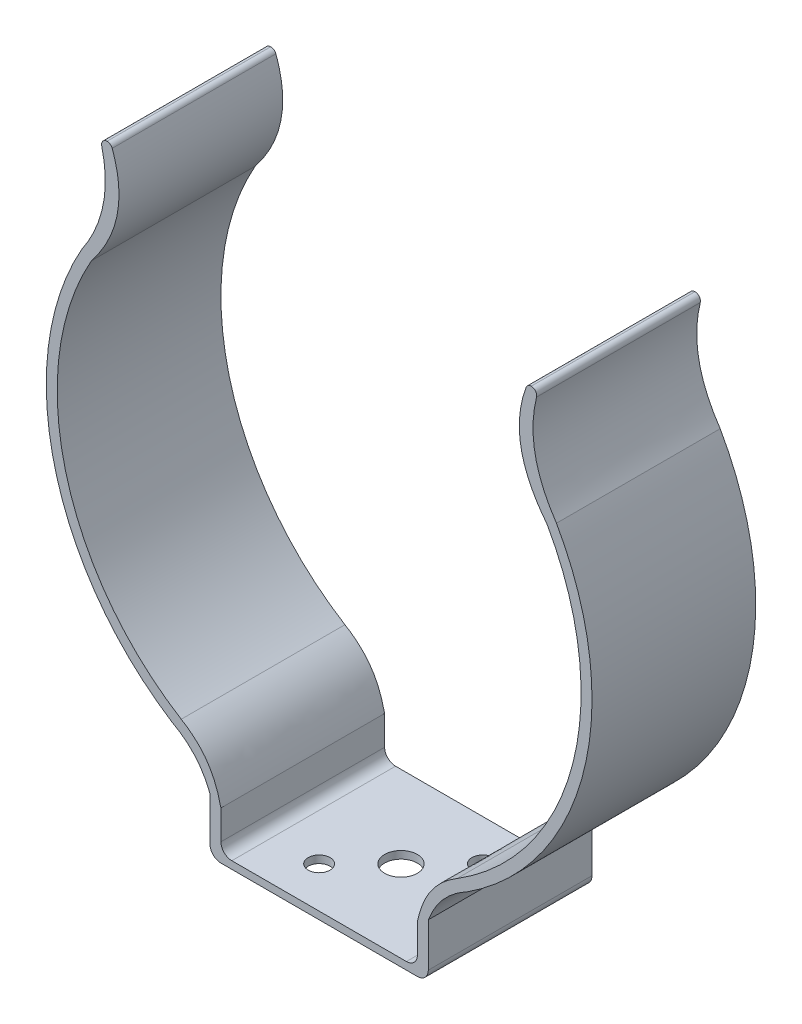
ISO-10303-21;
HEADER;
FILE_DESCRIPTION(('STEP AP214'),'2;1');
FILE_NAME('part.step','',(''),(''),'','','');
FILE_SCHEMA(('AUTOMOTIVE_DESIGN { 1 0 10303 214 1 1 1 1 }'));
ENDSEC;
DATA;
#1=APPLICATION_CONTEXT('core data for automotive mechanical design processes');
#2=APPLICATION_PROTOCOL_DEFINITION('international standard','automotive_design',2000,#1);
#3=PRODUCT_CONTEXT('',#1,'mechanical');
#4=PRODUCT('Part','Part','',(#3));
#5=PRODUCT_RELATED_PRODUCT_CATEGORY('part','',(#4));
#6=PRODUCT_DEFINITION_FORMATION('','',#4);
#7=PRODUCT_DEFINITION_CONTEXT('part definition',#1,'design');
#8=PRODUCT_DEFINITION('design','',#6,#7);
#9=PRODUCT_DEFINITION_SHAPE('','',#8);
#10=(LENGTH_UNIT() NAMED_UNIT(*) SI_UNIT(.MILLI.,.METRE.));
#11=(NAMED_UNIT(*) PLANE_ANGLE_UNIT() SI_UNIT($,.RADIAN.));
#12=(NAMED_UNIT(*) SI_UNIT($,.STERADIAN.) SOLID_ANGLE_UNIT());
#13=UNCERTAINTY_MEASURE_WITH_UNIT(LENGTH_MEASURE(1.E-05),#10,'distance_accuracy_value','');
#14=(GEOMETRIC_REPRESENTATION_CONTEXT(3) GLOBAL_UNCERTAINTY_ASSIGNED_CONTEXT((#13)) GLOBAL_UNIT_ASSIGNED_CONTEXT((#10,
#11,#12)) REPRESENTATION_CONTEXT('',''));
#15=CARTESIAN_POINT('',(0.,0.,0.));
#16=DIRECTION('',(0.,0.,1.));
#17=DIRECTION('',(1.,0.,0.));
#18=AXIS2_PLACEMENT_3D('',#15,#16,#17);
#19=CARTESIAN_POINT('',(-37.7417223823235,-58.7757168532688,41.91));
#20=CARTESIAN_POINT('',(-30.7257234779803,-62.4953821394087,41.91));
#21=CARTESIAN_POINT('',(-27.94,-69.85,41.91));
#22=B_SPLINE_CURVE_WITH_KNOTS('',2,(#19,#20,#21),.UNSPECIFIED.,.F.,.F.,(3,3),(0.,1.),.UNSPECIFIED.);
#23=DIRECTION('',(0.,0.,-1.));
#24=VECTOR('',#23,1.);
#25=SURFACE_OF_LINEAR_EXTRUSION('',#22,#24);
#26=CARTESIAN_POINT('',(-37.7417223823235,-58.7757168532688,0.));
#27=CARTESIAN_POINT('',(-30.7257234779803,-62.4953821394087,0.));
#28=CARTESIAN_POINT('',(-27.94,-69.85,0.));
#29=B_SPLINE_CURVE_WITH_KNOTS('',2,(#26,#27,#28),.UNSPECIFIED.,.F.,.F.,(3,3),(0.,1.),.UNSPECIFIED.);
#30=CARTESIAN_POINT('',(-37.7417223823235,-58.7757168532688,0.));
#31=VERTEX_POINT('',#30);
#32=CARTESIAN_POINT('',(-27.94,-69.85,0.));
#33=VERTEX_POINT('',#32);
#34=EDGE_CURVE('E241',#31,#33,#29,.T.);
#35=ORIENTED_EDGE('',*,*,#34,.T.);
#36=DIRECTION('',(0.,0.,-1.));
#37=VECTOR('',#36,1.);
#38=CARTESIAN_POINT('',(-27.94,-69.85,41.91));
#39=LINE('',#38,#37);
#40=CARTESIAN_POINT('',(-27.94,-69.85,41.91));
#41=VERTEX_POINT('',#40);
#42=EDGE_CURVE('E224',#41,#33,#39,.T.);
#43=ORIENTED_EDGE('',*,*,#42,.F.);
#44=CARTESIAN_POINT('',(-37.7417223823235,-58.7757168532688,41.91));
#45=VERTEX_POINT('',#44);
#46=EDGE_CURVE('E229',#45,#41,#22,.T.);
#47=ORIENTED_EDGE('',*,*,#46,.F.);
#48=DIRECTION('',(0.,0.,-1.));
#49=VECTOR('',#48,1.);
#50=CARTESIAN_POINT('',(-37.7417223823235,-58.7757168532688,41.91));
#51=LINE('',#50,#49);
#52=EDGE_CURVE('E443',#45,#31,#51,.T.);
#53=ORIENTED_EDGE('',*,*,#52,.T.);
#54=EDGE_LOOP('',(#35,#43,#47,#53));
#55=FACE_BOUND('',#54,.T.);
#56=ADVANCED_FACE('F35',(#55),#25,.F.);
#57=CARTESIAN_POINT('',(-27.94,-69.85,41.91));
#58=DIRECTION('',(1.,0.,0.));
#59=DIRECTION('',(0.,0.,-1.));
#60=AXIS2_PLACEMENT_3D('',#57,#58,#59);
#61=PLANE('',#60);
#62=DIRECTION('',(0.,-1.,0.));
#63=VECTOR('',#62,1.);
#64=CARTESIAN_POINT('',(-27.94,-69.85,0.));
#65=LINE('',#64,#63);
#66=CARTESIAN_POINT('',(-27.94,-81.026,0.));
#67=VERTEX_POINT('',#66);
#68=EDGE_CURVE('E603',#33,#67,#65,.T.);
#69=ORIENTED_EDGE('',*,*,#68,.T.);
#70=DIRECTION('',(0.,0.,-1.));
#71=VECTOR('',#70,1.);
#72=CARTESIAN_POINT('',(-27.94,-81.026,41.91));
#73=LINE('',#72,#71);
#74=CARTESIAN_POINT('',(-27.94,-81.026,41.91));
#75=VERTEX_POINT('',#74);
#76=EDGE_CURVE('E50',#67,#75,#73,.F.);
#77=ORIENTED_EDGE('',*,*,#76,.T.);
#78=DIRECTION('',(0.,-1.,0.));
#79=VECTOR('',#78,1.);
#80=CARTESIAN_POINT('',(-27.94,-69.85,41.91));
#81=LINE('',#80,#79);
#82=EDGE_CURVE('E220',#41,#75,#81,.T.);
#83=ORIENTED_EDGE('',*,*,#82,.F.);
#84=ORIENTED_EDGE('',*,*,#42,.T.);
#85=EDGE_LOOP('',(#69,#77,#83,#84));
#86=FACE_BOUND('',#85,.T.);
#87=ADVANCED_FACE('F222',(#86),#61,.F.);
#88=CARTESIAN_POINT('',(-27.94,-83.82,41.91));
#89=DIRECTION('',(0.,1.,0.));
#90=DIRECTION('',(0.,0.,1.));
#91=AXIS2_PLACEMENT_3D('',#88,#89,#90);
#92=PLANE('',#91);
#93=CARTESIAN_POINT('',(-10.4775,-83.82,31.4325));
#94=DIRECTION('',(0.,1.,0.));
#95=DIRECTION('',(0.,0.,1.));
#96=AXIS2_PLACEMENT_3D('',#93,#94,#95);
#97=CIRCLE('',#96,2.794);
#98=CARTESIAN_POINT('',(-10.4775,-83.82,34.2265));
#99=VERTEX_POINT('',#98);
#100=EDGE_CURVE('E897',#99,#99,#97,.T.);
#101=ORIENTED_EDGE('',*,*,#100,.T.);
#102=EDGE_LOOP('',(#101));
#103=FACE_BOUND('',#102,.T.);
#104=CARTESIAN_POINT('',(10.4775,-83.82,10.4775));
#105=DIRECTION('',(0.,1.,0.));
#106=DIRECTION('',(0.,0.,1.));
#107=AXIS2_PLACEMENT_3D('',#104,#105,#106);
#108=CIRCLE('',#107,2.794);
#109=CARTESIAN_POINT('',(10.4775,-83.82,13.2715));
#110=VERTEX_POINT('',#109);
#111=EDGE_CURVE('E901',#110,#110,#108,.T.);
#112=ORIENTED_EDGE('',*,*,#111,.T.);
#113=EDGE_LOOP('',(#112));
#114=FACE_BOUND('',#113,.T.);
#115=CARTESIAN_POINT('',(0.,-83.82,20.955));
#116=DIRECTION('',(0.,1.,0.));
#117=DIRECTION('',(0.,0.,1.));
#118=AXIS2_PLACEMENT_3D('',#115,#116,#117);
#119=CIRCLE('',#118,4.191);
#120=CARTESIAN_POINT('',(0.,-83.82,25.146));
#121=VERTEX_POINT('',#120);
#122=EDGE_CURVE('E592',#121,#121,#119,.T.);
#123=ORIENTED_EDGE('',*,*,#122,.T.);
#124=EDGE_LOOP('',(#123));
#125=FACE_BOUND('',#124,.T.);
#126=DIRECTION('',(1.,0.,0.));
#127=VECTOR('',#126,1.);
#128=CARTESIAN_POINT('',(-27.94,-83.82,0.));
#129=LINE('',#128,#127);
#130=CARTESIAN_POINT('',(-25.146,-83.82,0.));
#131=VERTEX_POINT('',#130);
#132=CARTESIAN_POINT('',(25.146,-83.82,0.));
#133=VERTEX_POINT('',#132);
#134=EDGE_CURVE('E602',#131,#133,#129,.T.);
#135=ORIENTED_EDGE('',*,*,#134,.T.);
#136=DIRECTION('',(0.,0.,-1.));
#137=VECTOR('',#136,1.);
#138=CARTESIAN_POINT('',(25.146,-83.82,41.91));
#139=LINE('',#138,#137);
#140=CARTESIAN_POINT('',(25.146,-83.82,41.91));
#141=VERTEX_POINT('',#140);
#142=EDGE_CURVE('E58',#133,#141,#139,.F.);
#143=ORIENTED_EDGE('',*,*,#142,.T.);
#144=DIRECTION('',(1.,0.,0.));
#145=VECTOR('',#144,1.);
#146=CARTESIAN_POINT('',(-27.94,-83.82,41.91));
#147=LINE('',#146,#145);
#148=CARTESIAN_POINT('',(-25.146,-83.82,41.91));
#149=VERTEX_POINT('',#148);
#150=EDGE_CURVE('E228',#149,#141,#147,.T.);
#151=ORIENTED_EDGE('',*,*,#150,.F.);
#152=DIRECTION('',(0.,0.,-1.));
#153=VECTOR('',#152,1.);
#154=CARTESIAN_POINT('',(-25.146,-83.82,41.91));
#155=LINE('',#154,#153);
#156=EDGE_CURVE('E302',#149,#131,#155,.T.);
#157=ORIENTED_EDGE('',*,*,#156,.T.);
#158=EDGE_LOOP('',(#135,#143,#151,#157));
#159=FACE_BOUND('',#158,.T.);
#160=ADVANCED_FACE('F586',(#103,#114,#125,#159),#92,.F.);
#161=CARTESIAN_POINT('',(27.94,-69.85,41.91));
#162=DIRECTION('',(-1.,0.,0.));
#163=DIRECTION('',(0.,0.,1.));
#164=AXIS2_PLACEMENT_3D('',#161,#162,#163);
#165=PLANE('',#164);
#166=DIRECTION('',(0.,1.,0.));
#167=VECTOR('',#166,1.);
#168=CARTESIAN_POINT('',(27.94,-69.85,41.91));
#169=LINE('',#168,#167);
#170=CARTESIAN_POINT('',(27.94,-81.026,41.91));
#171=VERTEX_POINT('',#170);
#172=CARTESIAN_POINT('',(27.94,-69.85,41.91));
#173=VERTEX_POINT('',#172);
#174=EDGE_CURVE('E560',#171,#173,#169,.T.);
#175=ORIENTED_EDGE('',*,*,#174,.F.);
#176=DIRECTION('',(0.,0.,-1.));
#177=VECTOR('',#176,1.);
#178=CARTESIAN_POINT('',(27.94,-81.026,41.91));
#179=LINE('',#178,#177);
#180=CARTESIAN_POINT('',(27.94,-81.026,0.));
#181=VERTEX_POINT('',#180);
#182=EDGE_CURVE('E295',#171,#181,#179,.T.);
#183=ORIENTED_EDGE('',*,*,#182,.T.);
#184=DIRECTION('',(0.,1.,0.));
#185=VECTOR('',#184,1.);
#186=CARTESIAN_POINT('',(27.94,-69.85,0.));
#187=LINE('',#186,#185);
#188=CARTESIAN_POINT('',(27.94,-69.85,0.));
#189=VERTEX_POINT('',#188);
#190=EDGE_CURVE('E483',#181,#189,#187,.T.);
#191=ORIENTED_EDGE('',*,*,#190,.T.);
#192=DIRECTION('',(0.,0.,-1.));
#193=VECTOR('',#192,1.);
#194=CARTESIAN_POINT('',(27.94,-69.85,41.91));
#195=LINE('',#194,#193);
#196=EDGE_CURVE('E243',#173,#189,#195,.T.);
#197=ORIENTED_EDGE('',*,*,#196,.F.);
#198=EDGE_LOOP('',(#175,#183,#191,#197));
#199=FACE_BOUND('',#198,.T.);
#200=ADVANCED_FACE('F553',(#199),#165,.F.);
#201=CARTESIAN_POINT('',(27.94,-69.85,41.91));
#202=CARTESIAN_POINT('',(30.7257234779803,-62.4953821394087,41.91));
#203=CARTESIAN_POINT('',(37.7417223823235,-58.7757168532688,41.91));
#204=B_SPLINE_CURVE_WITH_KNOTS('',2,(#201,#202,#203),.UNSPECIFIED.,.F.,.F.,(3,3),(0.,1.),.UNSPECIFIED.);
#205=DIRECTION('',(0.,0.,-1.));
#206=VECTOR('',#205,1.);
#207=SURFACE_OF_LINEAR_EXTRUSION('',#204,#206);
#208=CARTESIAN_POINT('',(27.94,-69.85,0.));
#209=CARTESIAN_POINT('',(30.7257234779803,-62.4953821394087,0.));
#210=CARTESIAN_POINT('',(37.7417223823235,-58.7757168532688,0.));
#211=B_SPLINE_CURVE_WITH_KNOTS('',2,(#208,#209,#210),.UNSPECIFIED.,.F.,.F.,(3,3),(0.,1.),.UNSPECIFIED.);
#212=CARTESIAN_POINT('',(37.7417223823235,-58.7757168532688,0.));
#213=VERTEX_POINT('',#212);
#214=EDGE_CURVE('E477',#189,#213,#211,.T.);
#215=ORIENTED_EDGE('',*,*,#214,.T.);
#216=DIRECTION('',(0.,0.,-1.));
#217=VECTOR('',#216,1.);
#218=CARTESIAN_POINT('',(37.7417223823235,-58.7757168532688,41.91));
#219=LINE('',#218,#217);
#220=CARTESIAN_POINT('',(37.7417223823235,-58.7757168532688,41.91));
#221=VERTEX_POINT('',#220);
#222=EDGE_CURVE('E248',#221,#213,#219,.T.);
#223=ORIENTED_EDGE('',*,*,#222,.F.);
#224=EDGE_CURVE('E555',#173,#221,#204,.T.);
#225=ORIENTED_EDGE('',*,*,#224,.F.);
#226=ORIENTED_EDGE('',*,*,#196,.T.);
#227=EDGE_LOOP('',(#215,#223,#225,#226));
#228=FACE_BOUND('',#227,.T.);
#229=ADVANCED_FACE('F549',(#228),#207,.F.);
#230=CARTESIAN_POINT('',(0.,0.,41.91));
#231=DIRECTION('',(0.,0.,-1.));
#232=DIRECTION('',(-1.,0.,0.));
#233=AXIS2_PLACEMENT_3D('',#230,#231,#232);
#234=CYLINDRICAL_SURFACE('',#233,69.85);
#235=CARTESIAN_POINT('',(0.,0.,0.));
#236=DIRECTION('',(0.,0.,1.));
#237=DIRECTION('',(1.,0.,0.));
#238=AXIS2_PLACEMENT_3D('',#235,#236,#237);
#239=CIRCLE('',#238,69.85);
#240=CARTESIAN_POINT('',(60.746853256944,34.4795927960194,0.));
#241=VERTEX_POINT('',#240);
#242=EDGE_CURVE('E471',#213,#241,#239,.T.);
#243=ORIENTED_EDGE('',*,*,#242,.T.);
#244=DIRECTION('',(0.,0.,-1.));
#245=VECTOR('',#244,1.);
#246=CARTESIAN_POINT('',(60.746853256944,34.4795927960194,41.91));
#247=LINE('',#246,#245);
#248=CARTESIAN_POINT('',(60.746853256944,34.4795927960194,41.91));
#249=VERTEX_POINT('',#248);
#250=EDGE_CURVE('E462',#249,#241,#247,.T.);
#251=ORIENTED_EDGE('',*,*,#250,.F.);
#252=CARTESIAN_POINT('',(0.,0.,41.91));
#253=DIRECTION('',(0.,0.,1.));
#254=DIRECTION('',(1.,0.,0.));
#255=AXIS2_PLACEMENT_3D('',#252,#253,#254);
#256=CIRCLE('',#255,69.85);
#257=EDGE_CURVE('E472',#221,#249,#256,.T.);
#258=ORIENTED_EDGE('',*,*,#257,.F.);
#259=ORIENTED_EDGE('',*,*,#222,.T.);
#260=EDGE_LOOP('',(#243,#251,#258,#259));
#261=FACE_BOUND('',#260,.T.);
#262=ADVANCED_FACE('F469',(#261),#234,.T.);
#263=CARTESIAN_POINT('',(60.746853256944,34.4795927960194,41.91));
#264=CARTESIAN_POINT('',(51.8584734263905,47.5166520458032,41.91));
#265=CARTESIAN_POINT('',(56.1335534346627,61.6254964464781,41.91));
#266=B_SPLINE_CURVE_WITH_KNOTS('',2,(#263,#264,#265),.UNSPECIFIED.,.F.,.F.,(3,3),(0.,1.),.UNSPECIFIED.);
#267=DIRECTION('',(0.,0.,-1.));
#268=VECTOR('',#267,1.);
#269=SURFACE_OF_LINEAR_EXTRUSION('',#266,#268);
#270=CARTESIAN_POINT('',(60.746853256944,34.4795927960194,0.));
#271=CARTESIAN_POINT('',(51.8584734263905,47.5166520458032,0.));
#272=CARTESIAN_POINT('',(56.1335534346627,61.6254964464781,0.));
#273=B_SPLINE_CURVE_WITH_KNOTS('',2,(#270,#271,#272),.UNSPECIFIED.,.F.,.F.,(3,3),(0.,1.),.UNSPECIFIED.);
#274=CARTESIAN_POINT('',(55.6574166996219,59.8938001117935,0.));
#275=VERTEX_POINT('',#274);
#276=EDGE_CURVE('E479',#241,#275,#273,.T.);
#277=ORIENTED_EDGE('',*,*,#276,.T.);
#278=DIRECTION('',(0.,0.,-1.));
#279=VECTOR('',#278,1.);
#280=CARTESIAN_POINT('',(55.6574166996219,59.8938001117935,0.));
#281=LINE('',#280,#279);
#282=CARTESIAN_POINT('',(55.6574166996219,59.8938001117935,41.91));
#283=VERTEX_POINT('',#282);
#284=EDGE_CURVE('E262',#275,#283,#281,.F.);
#285=ORIENTED_EDGE('',*,*,#284,.T.);
#286=EDGE_CURVE('E526',#249,#283,#266,.T.);
#287=ORIENTED_EDGE('',*,*,#286,.F.);
#288=ORIENTED_EDGE('',*,*,#250,.T.);
#289=EDGE_LOOP('',(#277,#285,#287,#288));
#290=FACE_BOUND('',#289,.T.);
#291=ADVANCED_FACE('F543',(#290),#269,.F.);
#292=CARTESIAN_POINT('',(56.1335534346627,61.6254964464781,41.91));
#293=DIRECTION('',(0.,-1.,0.));
#294=DIRECTION('',(0.,0.,-1.));
#295=AXIS2_PLACEMENT_3D('',#292,#293,#294);
#296=PLANE('',#295);
#297=DIRECTION('',(-1.,0.,0.));
#298=VECTOR('',#297,1.);
#299=CARTESIAN_POINT('',(56.1335534346627,61.6254964464781,41.91));
#300=LINE('',#299,#298);
#301=CARTESIAN_POINT('',(54.3011028113391,61.6254964464781,41.91));
#302=VERTEX_POINT('',#301);
#303=CARTESIAN_POINT('',(54.2968210341787,61.6254964464781,41.91));
#304=VERTEX_POINT('',#303);
#305=EDGE_CURVE('E522',#302,#304,#300,.T.);
#306=ORIENTED_EDGE('',*,*,#305,.F.);
#307=DIRECTION('',(0.,0.,-1.));
#308=VECTOR('',#307,1.);
#309=CARTESIAN_POINT('',(54.3011028113391,61.6254964464781,41.91));
#310=LINE('',#309,#308);
#311=CARTESIAN_POINT('',(54.3011028113391,61.6254964464781,0.));
#312=VERTEX_POINT('',#311);
#313=EDGE_CURVE('E245',#302,#312,#310,.T.);
#314=ORIENTED_EDGE('',*,*,#313,.T.);
#315=DIRECTION('',(-1.,0.,0.));
#316=VECTOR('',#315,1.);
#317=CARTESIAN_POINT('',(56.1335534346627,61.6254964464781,0.));
#318=LINE('',#317,#316);
#319=CARTESIAN_POINT('',(54.2968210341787,61.6254964464781,0.));
#320=VERTEX_POINT('',#319);
#321=EDGE_CURVE('E481',#312,#320,#318,.T.);
#322=ORIENTED_EDGE('',*,*,#321,.T.);
#323=DIRECTION('',(0.,0.,-1.));
#324=VECTOR('',#323,1.);
#325=CARTESIAN_POINT('',(54.2968210341787,61.6254964464781,41.91));
#326=LINE('',#325,#324);
#327=EDGE_CURVE('E242',#320,#304,#326,.F.);
#328=ORIENTED_EDGE('',*,*,#327,.T.);
#329=EDGE_LOOP('',(#306,#314,#322,#328));
#330=FACE_BOUND('',#329,.T.);
#331=ADVANCED_FACE('F521',(#330),#296,.F.);
#332=CARTESIAN_POINT('',(53.3395534346627,61.6254964464781,41.91));
#333=CARTESIAN_POINT('',(47.376177785021,46.872534249787,41.91));
#334=CARTESIAN_POINT('',(58.3169791266663,33.1004090841786,41.91));
#335=B_SPLINE_CURVE_WITH_KNOTS('',2,(#332,#333,#334),.UNSPECIFIED.,.F.,.F.,(3,3),(0.,1.),.UNSPECIFIED.);
#336=DIRECTION('',(0.,0.,-1.));
#337=VECTOR('',#336,1.);
#338=SURFACE_OF_LINEAR_EXTRUSION('',#335,#337);
#339=CARTESIAN_POINT('',(52.9864115288644,60.7126822872272,41.91));
#340=VERTEX_POINT('',#339);
#341=CARTESIAN_POINT('',(58.3169791266663,33.1004090841786,41.91));
#342=VERTEX_POINT('',#341);
#343=EDGE_CURVE('E513',#340,#342,#335,.T.);
#344=ORIENTED_EDGE('',*,*,#343,.F.);
#345=DIRECTION('',(0.,0.,-1.));
#346=VECTOR('',#345,1.);
#347=CARTESIAN_POINT('',(52.986411528864,60.712682287226,41.91));
#348=LINE('',#347,#346);
#349=CARTESIAN_POINT('',(52.9864115288644,60.7126822872272,0.));
#350=VERTEX_POINT('',#349);
#351=EDGE_CURVE('E272',#340,#350,#348,.T.);
#352=ORIENTED_EDGE('',*,*,#351,.T.);
#353=CARTESIAN_POINT('',(53.3395534346627,61.6254964464781,0.));
#354=CARTESIAN_POINT('',(47.376177785021,46.872534249787,0.));
#355=CARTESIAN_POINT('',(58.3169791266663,33.1004090841786,0.));
#356=B_SPLINE_CURVE_WITH_KNOTS('',2,(#353,#354,#355),.UNSPECIFIED.,.F.,.F.,(3,3),(0.,1.),.UNSPECIFIED.);
#357=CARTESIAN_POINT('',(58.3169791266663,33.1004090841786,0.));
#358=VERTEX_POINT('',#357);
#359=EDGE_CURVE('E496',#350,#358,#356,.T.);
#360=ORIENTED_EDGE('',*,*,#359,.T.);
#361=DIRECTION('',(0.,0.,-1.));
#362=VECTOR('',#361,1.);
#363=CARTESIAN_POINT('',(58.3169791266663,33.1004090841786,41.91));
#364=LINE('',#363,#362);
#365=EDGE_CURVE('E459',#342,#358,#364,.T.);
#366=ORIENTED_EDGE('',*,*,#365,.F.);
#367=EDGE_LOOP('',(#344,#352,#360,#366));
#368=FACE_BOUND('',#367,.T.);
#369=ADVANCED_FACE('F511',(#368),#338,.F.);
#370=CARTESIAN_POINT('',(0.,0.,41.91));
#371=DIRECTION('',(0.,0.,-1.));
#372=DIRECTION('',(-1.,0.,0.));
#373=AXIS2_PLACEMENT_3D('',#370,#371,#372);
#374=CYLINDRICAL_SURFACE('',#373,67.056);
#375=CARTESIAN_POINT('',(0.,0.,0.));
#376=DIRECTION('',(0.,0.,-1.));
#377=DIRECTION('',(1.,0.,0.));
#378=AXIS2_PLACEMENT_3D('',#375,#376,#377);
#379=CIRCLE('',#378,67.056);
#380=CARTESIAN_POINT('',(35.3061346468014,-57.0086308579844,0.));
#381=VERTEX_POINT('',#380);
#382=EDGE_CURVE('E408',#358,#381,#379,.T.);
#383=ORIENTED_EDGE('',*,*,#382,.T.);
#384=DIRECTION('',(0.,0.,-1.));
#385=VECTOR('',#384,1.);
#386=CARTESIAN_POINT('',(35.3061346468014,-57.0086308579844,41.91));
#387=LINE('',#386,#385);
#388=CARTESIAN_POINT('',(35.3061346468014,-57.0086308579844,41.91));
#389=VERTEX_POINT('',#388);
#390=EDGE_CURVE('E456',#389,#381,#387,.T.);
#391=ORIENTED_EDGE('',*,*,#390,.F.);
#392=CARTESIAN_POINT('',(0.,0.,41.91));
#393=DIRECTION('',(0.,0.,-1.));
#394=DIRECTION('',(1.,0.,0.));
#395=AXIS2_PLACEMENT_3D('',#392,#393,#394);
#396=CIRCLE('',#395,67.056);
#397=EDGE_CURVE('E388',#342,#389,#396,.T.);
#398=ORIENTED_EDGE('',*,*,#397,.F.);
#399=ORIENTED_EDGE('',*,*,#365,.T.);
#400=EDGE_LOOP('',(#383,#391,#398,#399));
#401=FACE_BOUND('',#400,.T.);
#402=ADVANCED_FACE('F380',(#401),#374,.F.);
#403=CARTESIAN_POINT('',(35.3061346468014,-57.0086308579844,41.91));
#404=CARTESIAN_POINT('',(29.3332564543234,-60.5888033480785,41.91));
#405=CARTESIAN_POINT('',(26.5695232104985,-65.2014625122237,41.91));
#406=CARTESIAN_POINT('',(25.146,-71.6015636039143,41.91));
#407=B_SPLINE_CURVE_WITH_KNOTS('',3,(#403,#404,#405,#406),.UNSPECIFIED.,.F.,.F.,(4,4),(0.,1.),.UNSPECIFIED.);
#408=DIRECTION('',(0.,0.,-1.));
#409=VECTOR('',#408,1.);
#410=SURFACE_OF_LINEAR_EXTRUSION('',#407,#409);
#411=CARTESIAN_POINT('',(35.3061346468014,-57.0086308579844,0.));
#412=CARTESIAN_POINT('',(29.3332564543234,-60.5888033480785,0.));
#413=CARTESIAN_POINT('',(26.5695232104985,-65.2014625122237,0.));
#414=CARTESIAN_POINT('',(25.146,-71.6015636039143,0.));
#415=B_SPLINE_CURVE_WITH_KNOTS('',3,(#411,#412,#413,#414),.UNSPECIFIED.,.F.,.F.,(4,4),(0.,1.),.UNSPECIFIED.);
#416=CARTESIAN_POINT('',(25.146,-71.6015636039143,0.));
#417=VERTEX_POINT('',#416);
#418=EDGE_CURVE('E406',#381,#417,#415,.T.);
#419=ORIENTED_EDGE('',*,*,#418,.T.);
#420=DIRECTION('',(0.,0.,-1.));
#421=VECTOR('',#420,1.);
#422=CARTESIAN_POINT('',(25.146,-71.6015636039143,41.91));
#423=LINE('',#422,#421);
#424=CARTESIAN_POINT('',(25.146,-71.6015636039143,41.91));
#425=VERTEX_POINT('',#424);
#426=EDGE_CURVE('E405',#425,#417,#423,.T.);
#427=ORIENTED_EDGE('',*,*,#426,.F.);
#428=EDGE_CURVE('E383',#389,#425,#407,.T.);
#429=ORIENTED_EDGE('',*,*,#428,.F.);
#430=ORIENTED_EDGE('',*,*,#390,.T.);
#431=EDGE_LOOP('',(#419,#427,#429,#430));
#432=FACE_BOUND('',#431,.T.);
#433=ADVANCED_FACE('F375',(#432),#410,.F.);
#434=CARTESIAN_POINT('',(25.146,-71.6015636039143,41.91));
#435=DIRECTION('',(1.,0.,0.));
#436=DIRECTION('',(0.,0.,-1.));
#437=AXIS2_PLACEMENT_3D('',#434,#435,#436);
#438=PLANE('',#437);
#439=DIRECTION('',(0.,-1.,0.));
#440=VECTOR('',#439,1.);
#441=CARTESIAN_POINT('',(25.146,-71.6015636039143,0.));
#442=LINE('',#441,#440);
#443=CARTESIAN_POINT('',(25.146,-79.1000961893467,0.));
#444=VERTEX_POINT('',#443);
#445=EDGE_CURVE('E331',#417,#444,#442,.T.);
#446=ORIENTED_EDGE('',*,*,#445,.T.);
#447=DIRECTION('',(0.,0.,-1.));
#448=VECTOR('',#447,1.);
#449=CARTESIAN_POINT('',(25.146,-79.1000961893467,41.91));
#450=LINE('',#449,#448);
#451=CARTESIAN_POINT('',(25.146,-79.1000961893467,41.91));
#452=VERTEX_POINT('',#451);
#453=EDGE_CURVE('E290',#444,#452,#450,.F.);
#454=ORIENTED_EDGE('',*,*,#453,.T.);
#455=DIRECTION('',(0.,-1.,0.));
#456=VECTOR('',#455,1.);
#457=CARTESIAN_POINT('',(25.146,-71.6015636039143,41.91));
#458=LINE('',#457,#456);
#459=EDGE_CURVE('E348',#425,#452,#458,.T.);
#460=ORIENTED_EDGE('',*,*,#459,.F.);
#461=ORIENTED_EDGE('',*,*,#426,.T.);
#462=EDGE_LOOP('',(#446,#454,#460,#461));
#463=FACE_BOUND('',#462,.T.);
#464=ADVANCED_FACE('F371',(#463),#438,.F.);
#465=CARTESIAN_POINT('',(-25.146,-81.8940961893467,41.91));
#466=DIRECTION('',(0.,-1.,0.));
#467=DIRECTION('',(0.,0.,-1.));
#468=AXIS2_PLACEMENT_3D('',#465,#466,#467);
#469=PLANE('',#468);
#470=CARTESIAN_POINT('',(-10.4775,-81.8940961893467,31.4325));
#471=DIRECTION('',(0.,1.,0.));
#472=DIRECTION('',(0.,0.,1.));
#473=AXIS2_PLACEMENT_3D('',#470,#471,#472);
#474=CIRCLE('',#473,2.794);
#475=CARTESIAN_POINT('',(-10.4775,-81.8940961893467,34.2265));
#476=VERTEX_POINT('',#475);
#477=EDGE_CURVE('E914',#476,#476,#474,.T.);
#478=ORIENTED_EDGE('',*,*,#477,.F.);
#479=EDGE_LOOP('',(#478));
#480=FACE_BOUND('',#479,.T.);
#481=CARTESIAN_POINT('',(10.4775,-81.8940961893467,10.4775));
#482=DIRECTION('',(0.,1.,0.));
#483=DIRECTION('',(0.,0.,1.));
#484=AXIS2_PLACEMENT_3D('',#481,#482,#483);
#485=CIRCLE('',#484,2.794);
#486=CARTESIAN_POINT('',(10.4775,-81.8940961893467,13.2715));
#487=VERTEX_POINT('',#486);
#488=EDGE_CURVE('E908',#487,#487,#485,.T.);
#489=ORIENTED_EDGE('',*,*,#488,.F.);
#490=EDGE_LOOP('',(#489));
#491=FACE_BOUND('',#490,.T.);
#492=CARTESIAN_POINT('',(0.,-81.8940961893467,20.955));
#493=DIRECTION('',(0.,1.,0.));
#494=DIRECTION('',(0.,0.,1.));
#495=AXIS2_PLACEMENT_3D('',#492,#493,#494);
#496=CIRCLE('',#495,4.191);
#497=CARTESIAN_POINT('',(0.,-81.8940961893467,25.146));
#498=VERTEX_POINT('',#497);
#499=EDGE_CURVE('E905',#498,#498,#496,.T.);
#500=ORIENTED_EDGE('',*,*,#499,.F.);
#501=EDGE_LOOP('',(#500));
#502=FACE_BOUND('',#501,.T.);
#503=DIRECTION('',(-1.,0.,0.));
#504=VECTOR('',#503,1.);
#505=CARTESIAN_POINT('',(-25.146,-81.8940961893467,41.91));
#506=LINE('',#505,#504);
#507=CARTESIAN_POINT('',(22.352,-81.8940961893467,41.91));
#508=VERTEX_POINT('',#507);
#509=CARTESIAN_POINT('',(-22.352,-81.8940961893467,41.91));
#510=VERTEX_POINT('',#509);
#511=EDGE_CURVE('E338',#508,#510,#506,.T.);
#512=ORIENTED_EDGE('',*,*,#511,.F.);
#513=DIRECTION('',(0.,0.,-1.));
#514=VECTOR('',#513,1.);
#515=CARTESIAN_POINT('',(22.352,-81.8940961893467,0.));
#516=LINE('',#515,#514);
#517=CARTESIAN_POINT('',(22.352,-81.8940961893467,0.));
#518=VERTEX_POINT('',#517);
#519=EDGE_CURVE('E287',#508,#518,#516,.T.);
#520=ORIENTED_EDGE('',*,*,#519,.T.);
#521=DIRECTION('',(-1.,0.,0.));
#522=VECTOR('',#521,1.);
#523=CARTESIAN_POINT('',(-25.146,-81.8940961893467,0.));
#524=LINE('',#523,#522);
#525=CARTESIAN_POINT('',(-22.352,-81.8940961893467,0.));
#526=VERTEX_POINT('',#525);
#527=EDGE_CURVE('E320',#518,#526,#524,.T.);
#528=ORIENTED_EDGE('',*,*,#527,.T.);
#529=DIRECTION('',(0.,0.,-1.));
#530=VECTOR('',#529,1.);
#531=CARTESIAN_POINT('',(-22.352,-81.8940961893467,41.91));
#532=LINE('',#531,#530);
#533=EDGE_CURVE('E285',#526,#510,#532,.F.);
#534=ORIENTED_EDGE('',*,*,#533,.T.);
#535=EDGE_LOOP('',(#512,#520,#528,#534));
#536=FACE_BOUND('',#535,.T.);
#537=ADVANCED_FACE('F328',(#480,#491,#502,#536),#469,.F.);
#538=CARTESIAN_POINT('',(-25.146,-71.6015636039143,41.91));
#539=DIRECTION('',(-1.,0.,0.));
#540=DIRECTION('',(0.,0.,1.));
#541=AXIS2_PLACEMENT_3D('',#538,#539,#540);
#542=PLANE('',#541);
#543=DIRECTION('',(0.,1.,0.));
#544=VECTOR('',#543,1.);
#545=CARTESIAN_POINT('',(-25.146,-71.6015636039143,41.91));
#546=LINE('',#545,#544);
#547=CARTESIAN_POINT('',(-25.146,-79.1000961893467,41.91));
#548=VERTEX_POINT('',#547);
#549=CARTESIAN_POINT('',(-25.146,-71.6015636039143,41.91));
#550=VERTEX_POINT('',#549);
#551=EDGE_CURVE('E336',#548,#550,#546,.T.);
#552=ORIENTED_EDGE('',*,*,#551,.F.);
#553=DIRECTION('',(0.,0.,-1.));
#554=VECTOR('',#553,1.);
#555=CARTESIAN_POINT('',(-25.146,-79.1000961893467,0.));
#556=LINE('',#555,#554);
#557=CARTESIAN_POINT('',(-25.146,-79.1000961893467,0.));
#558=VERTEX_POINT('',#557);
#559=EDGE_CURVE('E292',#548,#558,#556,.T.);
#560=ORIENTED_EDGE('',*,*,#559,.T.);
#561=DIRECTION('',(0.,1.,0.));
#562=VECTOR('',#561,1.);
#563=CARTESIAN_POINT('',(-25.146,-71.6015636039143,0.));
#564=LINE('',#563,#562);
#565=CARTESIAN_POINT('',(-25.146,-71.6015636039143,0.));
#566=VERTEX_POINT('',#565);
#567=EDGE_CURVE('E322',#558,#566,#564,.T.);
#568=ORIENTED_EDGE('',*,*,#567,.T.);
#569=DIRECTION('',(0.,0.,-1.));
#570=VECTOR('',#569,1.);
#571=CARTESIAN_POINT('',(-25.146,-71.6015636039143,41.91));
#572=LINE('',#571,#570);
#573=EDGE_CURVE('E342',#550,#566,#572,.T.);
#574=ORIENTED_EDGE('',*,*,#573,.F.);
#575=EDGE_LOOP('',(#552,#560,#568,#574));
#576=FACE_BOUND('',#575,.T.);
#577=ADVANCED_FACE('F340',(#576),#542,.F.);
#578=CARTESIAN_POINT('',(-25.146,-71.6015636039143,41.91));
#579=CARTESIAN_POINT('',(-26.5695232104985,-65.2014625122237,41.91));
#580=CARTESIAN_POINT('',(-29.3332564543234,-60.5888033480785,41.91));
#581=CARTESIAN_POINT('',(-35.3061346468014,-57.0086308579844,41.91));
#582=B_SPLINE_CURVE_WITH_KNOTS('',3,(#578,#579,#580,#581),.UNSPECIFIED.,.F.,.F.,(4,4),(0.,1.),.UNSPECIFIED.);
#583=DIRECTION('',(0.,0.,-1.));
#584=VECTOR('',#583,1.);
#585=SURFACE_OF_LINEAR_EXTRUSION('',#582,#584);
#586=CARTESIAN_POINT('',(-25.146,-71.6015636039143,0.));
#587=CARTESIAN_POINT('',(-26.5695232104985,-65.2014625122237,0.));
#588=CARTESIAN_POINT('',(-29.3332564543234,-60.5888033480785,0.));
#589=CARTESIAN_POINT('',(-35.3061346468014,-57.0086308579844,0.));
#590=B_SPLINE_CURVE_WITH_KNOTS('',3,(#586,#587,#588,#589),.UNSPECIFIED.,.F.,.F.,(4,4),(0.,1.),.UNSPECIFIED.);
#591=CARTESIAN_POINT('',(-35.3061346468014,-57.0086308579844,0.));
#592=VERTEX_POINT('',#591);
#593=EDGE_CURVE('E415',#566,#592,#590,.T.);
#594=ORIENTED_EDGE('',*,*,#593,.T.);
#595=DIRECTION('',(0.,0.,-1.));
#596=VECTOR('',#595,1.);
#597=CARTESIAN_POINT('',(-35.3061346468014,-57.0086308579844,41.91));
#598=LINE('',#597,#596);
#599=CARTESIAN_POINT('',(-35.3061346468014,-57.0086308579844,41.91));
#600=VERTEX_POINT('',#599);
#601=EDGE_CURVE('E451',#600,#592,#598,.T.);
#602=ORIENTED_EDGE('',*,*,#601,.F.);
#603=EDGE_CURVE('E344',#550,#600,#582,.T.);
#604=ORIENTED_EDGE('',*,*,#603,.F.);
#605=ORIENTED_EDGE('',*,*,#573,.T.);
#606=EDGE_LOOP('',(#594,#602,#604,#605));
#607=FACE_BOUND('',#606,.T.);
#608=ADVANCED_FACE('F360',(#607),#585,.F.);
#609=CARTESIAN_POINT('',(0.,0.,41.91));
#610=DIRECTION('',(0.,0.,-1.));
#611=DIRECTION('',(-1.,0.,0.));
#612=AXIS2_PLACEMENT_3D('',#609,#610,#611);
#613=CYLINDRICAL_SURFACE('',#612,67.056);
#614=CARTESIAN_POINT('',(0.,0.,0.));
#615=DIRECTION('',(0.,0.,-1.));
#616=DIRECTION('',(1.,0.,0.));
#617=AXIS2_PLACEMENT_3D('',#614,#615,#616);
#618=CIRCLE('',#617,67.056);
#619=CARTESIAN_POINT('',(-58.3169791266662,33.1004090841786,0.));
#620=VERTEX_POINT('',#619);
#621=EDGE_CURVE('E419',#592,#620,#618,.T.);
#622=ORIENTED_EDGE('',*,*,#621,.T.);
#623=DIRECTION('',(0.,0.,-1.));
#624=VECTOR('',#623,1.);
#625=CARTESIAN_POINT('',(-58.3169791266662,33.1004090841786,41.91));
#626=LINE('',#625,#624);
#627=CARTESIAN_POINT('',(-58.3169791266662,33.1004090841786,41.91));
#628=VERTEX_POINT('',#627);
#629=EDGE_CURVE('E448',#628,#620,#626,.T.);
#630=ORIENTED_EDGE('',*,*,#629,.F.);
#631=CARTESIAN_POINT('',(0.,0.,41.91));
#632=DIRECTION('',(0.,0.,-1.));
#633=DIRECTION('',(1.,0.,0.));
#634=AXIS2_PLACEMENT_3D('',#631,#632,#633);
#635=CIRCLE('',#634,67.056);
#636=EDGE_CURVE('E346',#600,#628,#635,.T.);
#637=ORIENTED_EDGE('',*,*,#636,.F.);
#638=ORIENTED_EDGE('',*,*,#601,.T.);
#639=EDGE_LOOP('',(#622,#630,#637,#638));
#640=FACE_BOUND('',#639,.T.);
#641=ADVANCED_FACE('F364',(#640),#613,.F.);
#642=CARTESIAN_POINT('',(-58.3169791266663,33.1004090841786,41.91));
#643=CARTESIAN_POINT('',(-47.376177785021,46.872534249787,41.91));
#644=CARTESIAN_POINT('',(-53.3395534346627,61.6254964464781,41.91));
#645=B_SPLINE_CURVE_WITH_KNOTS('',2,(#642,#643,#644),.UNSPECIFIED.,.F.,.F.,(3,3),(0.,1.),.UNSPECIFIED.);
#646=DIRECTION('',(0.,0.,-1.));
#647=VECTOR('',#646,1.);
#648=SURFACE_OF_LINEAR_EXTRUSION('',#645,#647);
#649=CARTESIAN_POINT('',(-58.3169791266663,33.1004090841786,0.));
#650=CARTESIAN_POINT('',(-47.376177785021,46.872534249787,0.));
#651=CARTESIAN_POINT('',(-53.3395534346627,61.6254964464781,0.));
#652=B_SPLINE_CURVE_WITH_KNOTS('',2,(#649,#650,#651),.UNSPECIFIED.,.F.,.F.,(3,3),(0.,1.),.UNSPECIFIED.);
#653=CARTESIAN_POINT('',(-52.9864115288644,60.7126822872272,0.));
#654=VERTEX_POINT('',#653);
#655=EDGE_CURVE('E424',#620,#654,#652,.T.);
#656=ORIENTED_EDGE('',*,*,#655,.T.);
#657=DIRECTION('',(0.,0.,-1.));
#658=VECTOR('',#657,1.);
#659=CARTESIAN_POINT('',(-52.986411528864,60.7126822872259,0.));
#660=LINE('',#659,#658);
#661=CARTESIAN_POINT('',(-52.9864115288644,60.7126822872272,41.91));
#662=VERTEX_POINT('',#661);
#663=EDGE_CURVE('E280',#654,#662,#660,.F.);
#664=ORIENTED_EDGE('',*,*,#663,.T.);
#665=EDGE_CURVE('E637',#628,#662,#645,.T.);
#666=ORIENTED_EDGE('',*,*,#665,.F.);
#667=ORIENTED_EDGE('',*,*,#629,.T.);
#668=EDGE_LOOP('',(#656,#664,#666,#667));
#669=FACE_BOUND('',#668,.T.);
#670=ADVANCED_FACE('F633',(#669),#648,.F.);
#671=CARTESIAN_POINT('',(-56.1335534346627,61.6254964464781,41.91));
#672=DIRECTION('',(0.,-1.,0.));
#673=DIRECTION('',(0.,0.,-1.));
#674=AXIS2_PLACEMENT_3D('',#671,#672,#673);
#675=PLANE('',#674);
#676=DIRECTION('',(-1.,0.,0.));
#677=VECTOR('',#676,1.);
#678=CARTESIAN_POINT('',(-56.1335534346627,61.6254964464781,41.91));
#679=LINE('',#678,#677);
#680=CARTESIAN_POINT('',(-54.2968210341787,61.6254964464781,41.91));
#681=VERTEX_POINT('',#680);
#682=CARTESIAN_POINT('',(-54.3011028113391,61.6254964464781,41.91));
#683=VERTEX_POINT('',#682);
#684=EDGE_CURVE('E619',#681,#683,#679,.T.);
#685=ORIENTED_EDGE('',*,*,#684,.F.);
#686=DIRECTION('',(0.,0.,-1.));
#687=VECTOR('',#686,1.);
#688=CARTESIAN_POINT('',(-54.2968210341787,61.6254964464781,41.91));
#689=LINE('',#688,#687);
#690=CARTESIAN_POINT('',(-54.2968210341787,61.6254964464781,0.));
#691=VERTEX_POINT('',#690);
#692=EDGE_CURVE('E277',#681,#691,#689,.T.);
#693=ORIENTED_EDGE('',*,*,#692,.T.);
#694=DIRECTION('',(-1.,0.,0.));
#695=VECTOR('',#694,1.);
#696=CARTESIAN_POINT('',(-56.1335534346627,61.6254964464781,0.));
#697=LINE('',#696,#695);
#698=CARTESIAN_POINT('',(-54.3011028113391,61.6254964464781,0.));
#699=VERTEX_POINT('',#698);
#700=EDGE_CURVE('E429',#691,#699,#697,.T.);
#701=ORIENTED_EDGE('',*,*,#700,.T.);
#702=DIRECTION('',(0.,0.,-1.));
#703=VECTOR('',#702,1.);
#704=CARTESIAN_POINT('',(-54.3011028113391,61.6254964464781,41.91));
#705=LINE('',#704,#703);
#706=EDGE_CURVE('E275',#699,#683,#705,.F.);
#707=ORIENTED_EDGE('',*,*,#706,.T.);
#708=EDGE_LOOP('',(#685,#693,#701,#707));
#709=FACE_BOUND('',#708,.T.);
#710=ADVANCED_FACE('F629',(#709),#675,.F.);
#711=CARTESIAN_POINT('',(-56.1335534346627,61.6254964464781,41.91));
#712=CARTESIAN_POINT('',(-51.8584734263905,47.5166520458032,41.91));
#713=CARTESIAN_POINT('',(-60.746853256944,34.4795927960194,41.91));
#714=B_SPLINE_CURVE_WITH_KNOTS('',2,(#711,#712,#713),.UNSPECIFIED.,.F.,.F.,(3,3),(0.,1.),.UNSPECIFIED.);
#715=DIRECTION('',(0.,0.,-1.));
#716=VECTOR('',#715,1.);
#717=SURFACE_OF_LINEAR_EXTRUSION('',#714,#716);
#718=CARTESIAN_POINT('',(-55.6574166996223,59.893800111795,41.91));
#719=VERTEX_POINT('',#718);
#720=CARTESIAN_POINT('',(-60.746853256944,34.4795927960194,41.91));
#721=VERTEX_POINT('',#720);
#722=EDGE_CURVE('E614',#719,#721,#714,.T.);
#723=ORIENTED_EDGE('',*,*,#722,.F.);
#724=DIRECTION('',(0.,0.,-1.));
#725=VECTOR('',#724,1.);
#726=CARTESIAN_POINT('',(-55.6574166996219,59.8938001117935,41.91));
#727=LINE('',#726,#725);
#728=CARTESIAN_POINT('',(-55.6574166996219,59.8938001117935,0.));
#729=VERTEX_POINT('',#728);
#730=EDGE_CURVE('E282',#719,#729,#727,.T.);
#731=ORIENTED_EDGE('',*,*,#730,.T.);
#732=CARTESIAN_POINT('',(-56.1335534346627,61.6254964464781,0.));
#733=CARTESIAN_POINT('',(-51.8584734263905,47.5166520458032,0.));
#734=CARTESIAN_POINT('',(-60.746853256944,34.4795927960194,0.));
#735=B_SPLINE_CURVE_WITH_KNOTS('',2,(#732,#733,#734),.UNSPECIFIED.,.F.,.F.,(3,3),(0.,1.),.UNSPECIFIED.);
#736=CARTESIAN_POINT('',(-60.746853256944,34.4795927960194,0.));
#737=VERTEX_POINT('',#736);
#738=EDGE_CURVE('E435',#729,#737,#735,.T.);
#739=ORIENTED_EDGE('',*,*,#738,.T.);
#740=DIRECTION('',(0.,0.,-1.));
#741=VECTOR('',#740,1.);
#742=CARTESIAN_POINT('',(-60.746853256944,34.4795927960194,41.91));
#743=LINE('',#742,#741);
#744=EDGE_CURVE('E445',#721,#737,#743,.T.);
#745=ORIENTED_EDGE('',*,*,#744,.F.);
#746=EDGE_LOOP('',(#723,#731,#739,#745));
#747=FACE_BOUND('',#746,.T.);
#748=ADVANCED_FACE('F624',(#747),#717,.F.);
#749=CARTESIAN_POINT('',(0.,0.,41.91));
#750=DIRECTION('',(0.,0.,-1.));
#751=DIRECTION('',(-1.,0.,0.));
#752=AXIS2_PLACEMENT_3D('',#749,#750,#751);
#753=CYLINDRICAL_SURFACE('',#752,69.85);
#754=CARTESIAN_POINT('',(0.,0.,0.));
#755=DIRECTION('',(0.,0.,1.));
#756=DIRECTION('',(1.,0.,0.));
#757=AXIS2_PLACEMENT_3D('',#754,#755,#756);
#758=CIRCLE('',#757,69.85);
#759=EDGE_CURVE('E238',#737,#31,#758,.T.);
#760=ORIENTED_EDGE('',*,*,#759,.T.);
#761=ORIENTED_EDGE('',*,*,#52,.F.);
#762=CARTESIAN_POINT('',(0.,0.,41.91));
#763=DIRECTION('',(0.,0.,1.));
#764=DIRECTION('',(1.,0.,0.));
#765=AXIS2_PLACEMENT_3D('',#762,#763,#764);
#766=CIRCLE('',#765,69.85);
#767=EDGE_CURVE('E234',#721,#45,#766,.T.);
#768=ORIENTED_EDGE('',*,*,#767,.F.);
#769=ORIENTED_EDGE('',*,*,#744,.T.);
#770=EDGE_LOOP('',(#760,#761,#768,#769));
#771=FACE_BOUND('',#770,.T.);
#772=ADVANCED_FACE('F628',(#771),#753,.T.);
#773=CARTESIAN_POINT('',(-31.783292334571,-63.4041202830216,41.91));
#774=DIRECTION('',(0.,0.,1.));
#775=DIRECTION('',(1.,0.,0.));
#776=AXIS2_PLACEMENT_3D('',#773,#774,#775);
#777=PLANE('',#776);
#778=ORIENTED_EDGE('',*,*,#150,.T.);
#779=CARTESIAN_POINT('',(25.146,-81.026,41.91));
#780=DIRECTION('',(0.,0.,1.));
#781=DIRECTION('',(1.,0.,0.));
#782=AXIS2_PLACEMENT_3D('',#779,#780,#781);
#783=CIRCLE('',#782,2.794);
#784=EDGE_CURVE('E308',#141,#171,#783,.T.);
#785=ORIENTED_EDGE('',*,*,#784,.T.);
#786=ORIENTED_EDGE('',*,*,#174,.T.);
#787=ORIENTED_EDGE('',*,*,#224,.T.);
#788=ORIENTED_EDGE('',*,*,#257,.T.);
#789=ORIENTED_EDGE('',*,*,#286,.T.);
#790=CARTESIAN_POINT('',(54.3011028113391,60.2284964464781,41.91));
#791=DIRECTION('',(0.,0.,1.));
#792=DIRECTION('',(1.,0.,0.));
#793=AXIS2_PLACEMENT_3D('',#790,#791,#792);
#794=CIRCLE('',#793,1.397);
#795=EDGE_CURVE('E270',#283,#302,#794,.T.);
#796=ORIENTED_EDGE('',*,*,#795,.T.);
#797=ORIENTED_EDGE('',*,*,#305,.T.);
#798=CARTESIAN_POINT('',(54.2968210341787,60.2284964464781,41.91));
#799=DIRECTION('',(0.,0.,1.));
#800=DIRECTION('',(1.,0.,0.));
#801=AXIS2_PLACEMENT_3D('',#798,#799,#800);
#802=CIRCLE('',#801,1.397);
#803=EDGE_CURVE('E268',#304,#340,#802,.T.);
#804=ORIENTED_EDGE('',*,*,#803,.T.);
#805=ORIENTED_EDGE('',*,*,#343,.T.);
#806=ORIENTED_EDGE('',*,*,#397,.T.);
#807=ORIENTED_EDGE('',*,*,#428,.T.);
#808=ORIENTED_EDGE('',*,*,#459,.T.);
#809=CARTESIAN_POINT('',(22.352,-79.1000961893467,41.91));
#810=DIRECTION('',(0.,0.,1.));
#811=DIRECTION('',(1.,0.,0.));
#812=AXIS2_PLACEMENT_3D('',#809,#810,#811);
#813=CIRCLE('',#812,2.794);
#814=EDGE_CURVE('E313',#452,#508,#813,.F.);
#815=ORIENTED_EDGE('',*,*,#814,.T.);
#816=ORIENTED_EDGE('',*,*,#511,.T.);
#817=CARTESIAN_POINT('',(-22.352,-79.1000961893467,41.91));
#818=DIRECTION('',(0.,0.,1.));
#819=DIRECTION('',(1.,0.,0.));
#820=AXIS2_PLACEMENT_3D('',#817,#818,#819);
#821=CIRCLE('',#820,2.794);
#822=EDGE_CURVE('E11',#510,#548,#821,.F.);
#823=ORIENTED_EDGE('',*,*,#822,.T.);
#824=ORIENTED_EDGE('',*,*,#551,.T.);
#825=ORIENTED_EDGE('',*,*,#603,.T.);
#826=ORIENTED_EDGE('',*,*,#636,.T.);
#827=ORIENTED_EDGE('',*,*,#665,.T.);
#828=CARTESIAN_POINT('',(-54.2968210341787,60.228496446478,41.91));
#829=DIRECTION('',(0.,0.,1.));
#830=DIRECTION('',(1.,0.,0.));
#831=AXIS2_PLACEMENT_3D('',#828,#829,#830);
#832=CIRCLE('',#831,1.397);
#833=EDGE_CURVE('E266',#662,#681,#832,.T.);
#834=ORIENTED_EDGE('',*,*,#833,.T.);
#835=ORIENTED_EDGE('',*,*,#684,.T.);
#836=CARTESIAN_POINT('',(-54.3011028113391,60.2284964464781,41.91));
#837=DIRECTION('',(0.,0.,1.));
#838=DIRECTION('',(1.,0.,0.));
#839=AXIS2_PLACEMENT_3D('',#836,#837,#838);
#840=CIRCLE('',#839,1.397);
#841=EDGE_CURVE('E264',#683,#719,#840,.T.);
#842=ORIENTED_EDGE('',*,*,#841,.T.);
#843=ORIENTED_EDGE('',*,*,#722,.T.);
#844=ORIENTED_EDGE('',*,*,#767,.T.);
#845=ORIENTED_EDGE('',*,*,#46,.T.);
#846=ORIENTED_EDGE('',*,*,#82,.T.);
#847=CARTESIAN_POINT('',(-25.146,-81.026,41.91));
#848=DIRECTION('',(0.,0.,1.));
#849=DIRECTION('',(1.,0.,0.));
#850=AXIS2_PLACEMENT_3D('',#847,#848,#849);
#851=CIRCLE('',#850,2.794);
#852=EDGE_CURVE('E306',#75,#149,#851,.T.);
#853=ORIENTED_EDGE('',*,*,#852,.T.);
#854=EDGE_LOOP('',(#778,#785,#786,#787,#788,#789,#796,#797,#804,#805,#806,#807,#808,#815,#816,
#823,#824,#825,#826,#827,#834,#835,#842,#843,#844,#845,#846,#853));
#855=FACE_BOUND('',#854,.T.);
#856=ADVANCED_FACE('F232',(#855),#777,.T.);
#857=CARTESIAN_POINT('',(-31.783292334571,-63.4041202830216,0.));
#858=DIRECTION('',(0.,0.,1.));
#859=DIRECTION('',(1.,0.,0.));
#860=AXIS2_PLACEMENT_3D('',#857,#858,#859);
#861=PLANE('',#860);
#862=ORIENTED_EDGE('',*,*,#190,.F.);
#863=CARTESIAN_POINT('',(25.146,-81.026,0.));
#864=DIRECTION('',(0.,0.,1.));
#865=DIRECTION('',(1.,0.,0.));
#866=AXIS2_PLACEMENT_3D('',#863,#864,#865);
#867=CIRCLE('',#866,2.794);
#868=EDGE_CURVE('E300',#181,#133,#867,.F.);
#869=ORIENTED_EDGE('',*,*,#868,.T.);
#870=ORIENTED_EDGE('',*,*,#134,.F.);
#871=CARTESIAN_POINT('',(-25.146,-81.026,0.));
#872=DIRECTION('',(0.,0.,1.));
#873=DIRECTION('',(1.,0.,0.));
#874=AXIS2_PLACEMENT_3D('',#871,#872,#873);
#875=CIRCLE('',#874,2.794);
#876=EDGE_CURVE('E298',#131,#67,#875,.F.);
#877=ORIENTED_EDGE('',*,*,#876,.T.);
#878=ORIENTED_EDGE('',*,*,#68,.F.);
#879=ORIENTED_EDGE('',*,*,#34,.F.);
#880=ORIENTED_EDGE('',*,*,#759,.F.);
#881=ORIENTED_EDGE('',*,*,#738,.F.);
#882=CARTESIAN_POINT('',(-54.3011028113391,60.2284964464781,0.));
#883=DIRECTION('',(0.,0.,1.));
#884=DIRECTION('',(1.,0.,0.));
#885=AXIS2_PLACEMENT_3D('',#882,#883,#884);
#886=CIRCLE('',#885,1.397);
#887=EDGE_CURVE('E254',#729,#699,#886,.F.);
#888=ORIENTED_EDGE('',*,*,#887,.T.);
#889=ORIENTED_EDGE('',*,*,#700,.F.);
#890=CARTESIAN_POINT('',(-54.2968210341787,60.228496446478,0.));
#891=DIRECTION('',(0.,0.,1.));
#892=DIRECTION('',(1.,0.,0.));
#893=AXIS2_PLACEMENT_3D('',#890,#891,#892);
#894=CIRCLE('',#893,1.397);
#895=EDGE_CURVE('E256',#691,#654,#894,.F.);
#896=ORIENTED_EDGE('',*,*,#895,.T.);
#897=ORIENTED_EDGE('',*,*,#655,.F.);
#898=ORIENTED_EDGE('',*,*,#621,.F.);
#899=ORIENTED_EDGE('',*,*,#593,.F.);
#900=ORIENTED_EDGE('',*,*,#567,.F.);
#901=CARTESIAN_POINT('',(-22.352,-79.1000961893467,0.));
#902=DIRECTION('',(0.,0.,1.));
#903=DIRECTION('',(1.,0.,0.));
#904=AXIS2_PLACEMENT_3D('',#901,#902,#903);
#905=CIRCLE('',#904,2.794);
#906=EDGE_CURVE('E43',#558,#526,#905,.T.);
#907=ORIENTED_EDGE('',*,*,#906,.T.);
#908=ORIENTED_EDGE('',*,*,#527,.F.);
#909=CARTESIAN_POINT('',(22.352,-79.1000961893467,0.));
#910=DIRECTION('',(0.,0.,1.));
#911=DIRECTION('',(1.,0.,0.));
#912=AXIS2_PLACEMENT_3D('',#909,#910,#911);
#913=CIRCLE('',#912,2.794);
#914=EDGE_CURVE('E311',#518,#444,#913,.T.);
#915=ORIENTED_EDGE('',*,*,#914,.T.);
#916=ORIENTED_EDGE('',*,*,#445,.F.);
#917=ORIENTED_EDGE('',*,*,#418,.F.);
#918=ORIENTED_EDGE('',*,*,#382,.F.);
#919=ORIENTED_EDGE('',*,*,#359,.F.);
#920=CARTESIAN_POINT('',(54.2968210341787,60.2284964464781,0.));
#921=DIRECTION('',(0.,0.,1.));
#922=DIRECTION('',(1.,0.,0.));
#923=AXIS2_PLACEMENT_3D('',#920,#921,#922);
#924=CIRCLE('',#923,1.397);
#925=EDGE_CURVE('E258',#350,#320,#924,.F.);
#926=ORIENTED_EDGE('',*,*,#925,.T.);
#927=ORIENTED_EDGE('',*,*,#321,.F.);
#928=CARTESIAN_POINT('',(54.3011028113391,60.2284964464781,0.));
#929=DIRECTION('',(0.,0.,1.));
#930=DIRECTION('',(1.,0.,0.));
#931=AXIS2_PLACEMENT_3D('',#928,#929,#930);
#932=CIRCLE('',#931,1.397);
#933=EDGE_CURVE('E260',#312,#275,#932,.F.);
#934=ORIENTED_EDGE('',*,*,#933,.T.);
#935=ORIENTED_EDGE('',*,*,#276,.F.);
#936=ORIENTED_EDGE('',*,*,#242,.F.);
#937=ORIENTED_EDGE('',*,*,#214,.F.);
#938=EDGE_LOOP('',(#862,#869,#870,#877,#878,#879,#880,#881,#888,#889,#896,#897,#898,#899,#900,
#907,#908,#915,#916,#917,#918,#919,#926,#927,#934,#935,#936,#937));
#939=FACE_BOUND('',#938,.T.);
#940=ADVANCED_FACE('F319',(#939),#861,.F.);
#941=CARTESIAN_POINT('',(0.,-84.6880961893467,20.955));
#942=DIRECTION('',(0.,1.,0.));
#943=DIRECTION('',(0.,0.,1.));
#944=AXIS2_PLACEMENT_3D('',#941,#942,#943);
#945=CYLINDRICAL_SURFACE('',#944,4.191);
#946=ORIENTED_EDGE('',*,*,#499,.T.);
#947=EDGE_LOOP('',(#946));
#948=FACE_BOUND('',#947,.T.);
#949=ORIENTED_EDGE('',*,*,#122,.F.);
#950=EDGE_LOOP('',(#949));
#951=FACE_BOUND('',#950,.T.);
#952=ADVANCED_FACE('F741',(#948,#951),#945,.F.);
#953=CARTESIAN_POINT('',(10.4775,-84.6880961893467,10.4775));
#954=DIRECTION('',(0.,1.,0.));
#955=DIRECTION('',(0.,0.,1.));
#956=AXIS2_PLACEMENT_3D('',#953,#954,#955);
#957=CYLINDRICAL_SURFACE('',#956,2.794);
#958=ORIENTED_EDGE('',*,*,#488,.T.);
#959=EDGE_LOOP('',(#958));
#960=FACE_BOUND('',#959,.T.);
#961=ORIENTED_EDGE('',*,*,#111,.F.);
#962=EDGE_LOOP('',(#961));
#963=FACE_BOUND('',#962,.T.);
#964=ADVANCED_FACE('F578',(#960,#963),#957,.F.);
#965=CARTESIAN_POINT('',(-10.4775,-84.6880961893467,31.4325));
#966=DIRECTION('',(0.,1.,0.));
#967=DIRECTION('',(0.,0.,1.));
#968=AXIS2_PLACEMENT_3D('',#965,#966,#967);
#969=CYLINDRICAL_SURFACE('',#968,2.794);
#970=ORIENTED_EDGE('',*,*,#477,.T.);
#971=EDGE_LOOP('',(#970));
#972=FACE_BOUND('',#971,.T.);
#973=ORIENTED_EDGE('',*,*,#100,.F.);
#974=EDGE_LOOP('',(#973));
#975=FACE_BOUND('',#974,.T.);
#976=ADVANCED_FACE('F570',(#972,#975),#969,.F.);
#977=CARTESIAN_POINT('',(54.3011028113391,60.2284964464781,20.955));
#978=DIRECTION('',(0.,0.,-1.));
#979=DIRECTION('',(-1.,0.,0.));
#980=AXIS2_PLACEMENT_3D('',#977,#978,#979);
#981=CYLINDRICAL_SURFACE('',#980,1.397);
#982=ORIENTED_EDGE('',*,*,#795,.F.);
#983=ORIENTED_EDGE('',*,*,#284,.F.);
#984=ORIENTED_EDGE('',*,*,#933,.F.);
#985=ORIENTED_EDGE('',*,*,#313,.F.);
#986=EDGE_LOOP('',(#982,#983,#984,#985));
#987=FACE_BOUND('',#986,.T.);
#988=ADVANCED_FACE('F568',(#987),#981,.T.);
#989=CARTESIAN_POINT('',(54.2968210341787,60.2284964464781,20.955));
#990=DIRECTION('',(0.,0.,-1.));
#991=DIRECTION('',(-1.,0.,0.));
#992=AXIS2_PLACEMENT_3D('',#989,#990,#991);
#993=CYLINDRICAL_SURFACE('',#992,1.397);
#994=ORIENTED_EDGE('',*,*,#803,.F.);
#995=ORIENTED_EDGE('',*,*,#327,.F.);
#996=ORIENTED_EDGE('',*,*,#925,.F.);
#997=ORIENTED_EDGE('',*,*,#351,.F.);
#998=EDGE_LOOP('',(#994,#995,#996,#997));
#999=FACE_BOUND('',#998,.T.);
#1000=ADVANCED_FACE('F516',(#999),#993,.T.);
#1001=CARTESIAN_POINT('',(-54.2968210341787,60.228496446478,20.955));
#1002=DIRECTION('',(0.,0.,-1.));
#1003=DIRECTION('',(-1.,0.,0.));
#1004=AXIS2_PLACEMENT_3D('',#1001,#1002,#1003);
#1005=CYLINDRICAL_SURFACE('',#1004,1.397);
#1006=ORIENTED_EDGE('',*,*,#833,.F.);
#1007=ORIENTED_EDGE('',*,*,#663,.F.);
#1008=ORIENTED_EDGE('',*,*,#895,.F.);
#1009=ORIENTED_EDGE('',*,*,#692,.F.);
#1010=EDGE_LOOP('',(#1006,#1007,#1008,#1009));
#1011=FACE_BOUND('',#1010,.T.);
#1012=ADVANCED_FACE('F576',(#1011),#1005,.T.);
#1013=CARTESIAN_POINT('',(-54.3011028113391,60.2284964464781,20.955));
#1014=DIRECTION('',(0.,0.,-1.));
#1015=DIRECTION('',(-1.,0.,0.));
#1016=AXIS2_PLACEMENT_3D('',#1013,#1014,#1015);
#1017=CYLINDRICAL_SURFACE('',#1016,1.397);
#1018=ORIENTED_EDGE('',*,*,#841,.F.);
#1019=ORIENTED_EDGE('',*,*,#706,.F.);
#1020=ORIENTED_EDGE('',*,*,#887,.F.);
#1021=ORIENTED_EDGE('',*,*,#730,.F.);
#1022=EDGE_LOOP('',(#1018,#1019,#1020,#1021));
#1023=FACE_BOUND('',#1022,.T.);
#1024=ADVANCED_FACE('F662',(#1023),#1017,.T.);
#1025=CARTESIAN_POINT('',(22.352,-79.1000961893467,41.91));
#1026=DIRECTION('',(0.,0.,1.));
#1027=DIRECTION('',(1.,0.,0.));
#1028=AXIS2_PLACEMENT_3D('',#1025,#1026,#1027);
#1029=CYLINDRICAL_SURFACE('',#1028,2.794);
#1030=ORIENTED_EDGE('',*,*,#814,.F.);
#1031=ORIENTED_EDGE('',*,*,#453,.F.);
#1032=ORIENTED_EDGE('',*,*,#914,.F.);
#1033=ORIENTED_EDGE('',*,*,#519,.F.);
#1034=EDGE_LOOP('',(#1030,#1031,#1032,#1033));
#1035=FACE_BOUND('',#1034,.T.);
#1036=ADVANCED_FACE('F401',(#1035),#1029,.F.);
#1037=CARTESIAN_POINT('',(-22.352,-79.1000961893467,41.91));
#1038=DIRECTION('',(0.,0.,1.));
#1039=DIRECTION('',(1.,0.,0.));
#1040=AXIS2_PLACEMENT_3D('',#1037,#1038,#1039);
#1041=CYLINDRICAL_SURFACE('',#1040,2.794);
#1042=ORIENTED_EDGE('',*,*,#822,.F.);
#1043=ORIENTED_EDGE('',*,*,#533,.F.);
#1044=ORIENTED_EDGE('',*,*,#906,.F.);
#1045=ORIENTED_EDGE('',*,*,#559,.F.);
#1046=EDGE_LOOP('',(#1042,#1043,#1044,#1045));
#1047=FACE_BOUND('',#1046,.T.);
#1048=ADVANCED_FACE('F334',(#1047),#1041,.F.);
#1049=CARTESIAN_POINT('',(25.146,-81.026,41.91));
#1050=DIRECTION('',(0.,0.,-1.));
#1051=DIRECTION('',(-1.,0.,0.));
#1052=AXIS2_PLACEMENT_3D('',#1049,#1050,#1051);
#1053=CYLINDRICAL_SURFACE('',#1052,2.794);
#1054=ORIENTED_EDGE('',*,*,#784,.F.);
#1055=ORIENTED_EDGE('',*,*,#142,.F.);
#1056=ORIENTED_EDGE('',*,*,#868,.F.);
#1057=ORIENTED_EDGE('',*,*,#182,.F.);
#1058=EDGE_LOOP('',(#1054,#1055,#1056,#1057));
#1059=FACE_BOUND('',#1058,.T.);
#1060=ADVANCED_FACE('F673',(#1059),#1053,.T.);
#1061=CARTESIAN_POINT('',(-25.146,-81.026,41.91));
#1062=DIRECTION('',(0.,0.,-1.));
#1063=DIRECTION('',(-1.,0.,0.));
#1064=AXIS2_PLACEMENT_3D('',#1061,#1062,#1063);
#1065=CYLINDRICAL_SURFACE('',#1064,2.794);
#1066=ORIENTED_EDGE('',*,*,#852,.F.);
#1067=ORIENTED_EDGE('',*,*,#76,.F.);
#1068=ORIENTED_EDGE('',*,*,#876,.F.);
#1069=ORIENTED_EDGE('',*,*,#156,.F.);
#1070=EDGE_LOOP('',(#1066,#1067,#1068,#1069));
#1071=FACE_BOUND('',#1070,.T.);
#1072=ADVANCED_FACE('F37',(#1071),#1065,.T.);
#1073=CLOSED_SHELL('',(#56,#87,#160,#200,#229,#262,#291,#331,#369,#402,#433,#464,#537,#577,#608,
#641,#670,#710,#748,#772,#856,#940,#952,#964,#976,#988,#1000,#1012,#1024,#1036,#1048,#1060,#1072));
#1074=MANIFOLD_SOLID_BREP('B2',#1073);
#1075=ADVANCED_BREP_SHAPE_REPRESENTATION('',(#18,#1074),#14);
#1076=SHAPE_DEFINITION_REPRESENTATION(#9,#1075);
ENDSEC;
END-ISO-10303-21;
